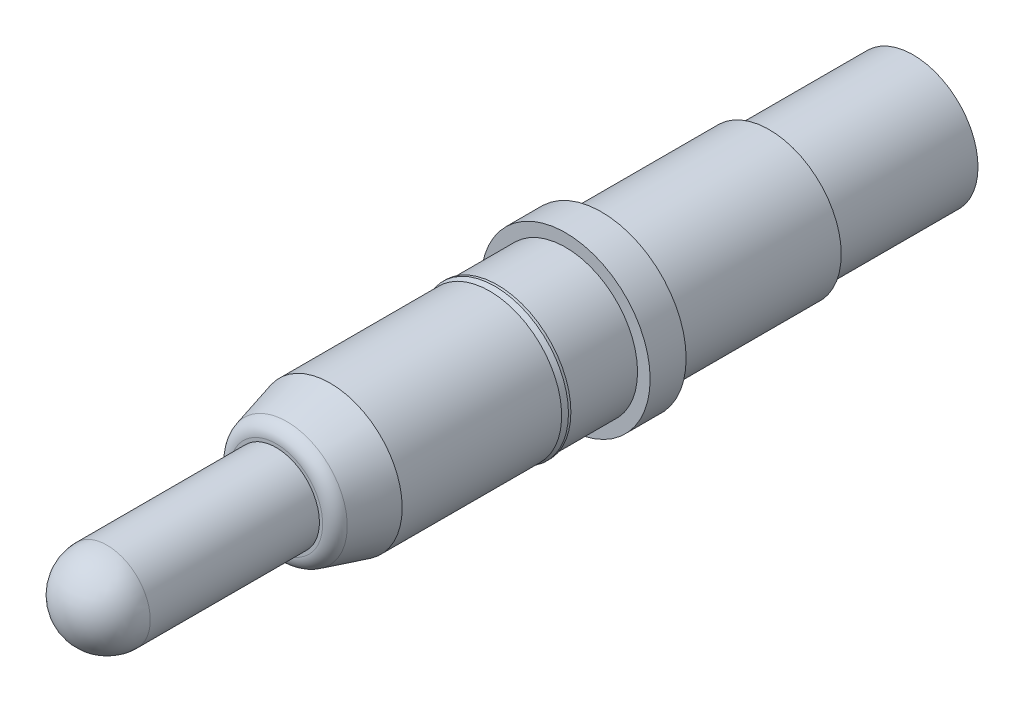
ISO-10303-21;
HEADER;
FILE_DESCRIPTION(('STEP AP214'),'2;1');
FILE_NAME('part.step','',(''),(''),'','','');
FILE_SCHEMA(('AUTOMOTIVE_DESIGN { 1 0 10303 214 1 1 1 1 }'));
ENDSEC;
DATA;
#1=APPLICATION_CONTEXT('core data for automotive mechanical design processes');
#2=APPLICATION_PROTOCOL_DEFINITION('international standard','automotive_design',2000,#1);
#3=PRODUCT_CONTEXT('',#1,'mechanical');
#4=PRODUCT('Part','Part','',(#3));
#5=PRODUCT_RELATED_PRODUCT_CATEGORY('part','',(#4));
#6=PRODUCT_DEFINITION_FORMATION('','',#4);
#7=PRODUCT_DEFINITION_CONTEXT('part definition',#1,'design');
#8=PRODUCT_DEFINITION('design','',#6,#7);
#9=PRODUCT_DEFINITION_SHAPE('','',#8);
#10=(LENGTH_UNIT() NAMED_UNIT(*) SI_UNIT(.MILLI.,.METRE.));
#11=(NAMED_UNIT(*) PLANE_ANGLE_UNIT() SI_UNIT($,.RADIAN.));
#12=(NAMED_UNIT(*) SI_UNIT($,.STERADIAN.) SOLID_ANGLE_UNIT());
#13=UNCERTAINTY_MEASURE_WITH_UNIT(LENGTH_MEASURE(1.E-05),#10,'distance_accuracy_value','');
#14=(GEOMETRIC_REPRESENTATION_CONTEXT(3) GLOBAL_UNCERTAINTY_ASSIGNED_CONTEXT((#13)) GLOBAL_UNIT_ASSIGNED_CONTEXT((#10,
#11,#12)) REPRESENTATION_CONTEXT('',''));
#15=CARTESIAN_POINT('',(0.,0.,0.));
#16=DIRECTION('',(0.,0.,1.));
#17=DIRECTION('',(1.,0.,0.));
#18=AXIS2_PLACEMENT_3D('',#15,#16,#17);
#19=CARTESIAN_POINT('',(0.,0.,6.37));
#20=DIRECTION('',(0.,-1.,0.));
#21=DIRECTION('',(0.,0.,-1.));
#22=AXIS2_PLACEMENT_3D('',#19,#20,#21);
#23=SPHERICAL_SURFACE('',#22,0.6);
#24=CARTESIAN_POINT('',(0.,0.,6.37));
#25=DIRECTION('',(0.,0.,1.));
#26=DIRECTION('',(0.,-1.,0.));
#27=AXIS2_PLACEMENT_3D('',#24,#25,#26);
#28=CIRCLE('',#27,0.6);
#29=CARTESIAN_POINT('',(0.,0.6,6.37));
#30=VERTEX_POINT('',#29);
#31=CARTESIAN_POINT('',(0.,-0.6,6.37));
#32=VERTEX_POINT('',#31);
#33=EDGE_CURVE('E35',#30,#32,#28,.F.);
#34=ORIENTED_EDGE('',*,*,#33,.F.);
#35=CARTESIAN_POINT('',(0.,0.,6.37));
#36=DIRECTION('',(0.,0.,1.));
#37=DIRECTION('',(0.,-1.,0.));
#38=AXIS2_PLACEMENT_3D('',#35,#36,#37);
#39=CIRCLE('',#38,0.6);
#40=EDGE_CURVE('E37',#32,#30,#39,.F.);
#41=ORIENTED_EDGE('',*,*,#40,.F.);
#42=EDGE_LOOP('',(#34,#41));
#43=FACE_BOUND('',#42,.T.);
#44=ADVANCED_FACE('F18',(#43),#23,.T.);
#45=CARTESIAN_POINT('',(0.,0.,6.97));
#46=DIRECTION('',(0.,0.,1.));
#47=DIRECTION('',(0.,-1.,0.));
#48=AXIS2_PLACEMENT_3D('',#45,#46,#47);
#49=CYLINDRICAL_SURFACE('',#48,0.6);
#50=CARTESIAN_POINT('',(0.,0.,4.02));
#51=DIRECTION('',(0.,0.,1.));
#52=DIRECTION('',(0.,-1.,0.));
#53=AXIS2_PLACEMENT_3D('',#50,#51,#52);
#54=CIRCLE('',#53,0.6);
#55=CARTESIAN_POINT('',(0.,-0.6,4.02));
#56=VERTEX_POINT('',#55);
#57=EDGE_CURVE('E44',#56,#56,#54,.T.);
#58=ORIENTED_EDGE('',*,*,#57,.T.);
#59=EDGE_LOOP('',(#58));
#60=FACE_BOUND('',#59,.T.);
#61=ORIENTED_EDGE('',*,*,#33,.T.);
#62=ORIENTED_EDGE('',*,*,#40,.T.);
#63=EDGE_LOOP('',(#61,#62));
#64=FACE_BOUND('',#63,.T.);
#65=ADVANCED_FACE('F42',(#60,#64),#49,.T.);
#66=CARTESIAN_POINT('',(0.,0.,4.02));
#67=DIRECTION('',(0.,0.,-1.));
#68=DIRECTION('',(-1.,0.,0.));
#69=AXIS2_PLACEMENT_3D('',#66,#67,#68);
#70=PLANE('',#69);
#71=CARTESIAN_POINT('',(0.,0.,4.02));
#72=DIRECTION('',(0.,0.,-1.));
#73=DIRECTION('',(-1.,0.,0.));
#74=AXIS2_PLACEMENT_3D('',#71,#72,#73);
#75=CIRCLE('',#74,0.645572708080866);
#76=CARTESIAN_POINT('',(-0.645572708080866,0.,4.02));
#77=VERTEX_POINT('',#76);
#78=EDGE_CURVE('E49',#77,#77,#75,.T.);
#79=ORIENTED_EDGE('',*,*,#78,.F.);
#80=EDGE_LOOP('',(#79));
#81=FACE_BOUND('',#80,.T.);
#82=ORIENTED_EDGE('',*,*,#57,.F.);
#83=EDGE_LOOP('',(#82));
#84=FACE_BOUND('',#83,.T.);
#85=ADVANCED_FACE('F146',(#81,#84),#70,.F.);
#86=CARTESIAN_POINT('',(0.,0.,3.82));
#87=DIRECTION('',(0.,0.,-1.));
#88=DIRECTION('',(-1.,0.,0.));
#89=AXIS2_PLACEMENT_3D('',#86,#87,#88);
#90=TOROIDAL_SURFACE('',#89,0.645572708080866,0.2);
#91=ORIENTED_EDGE('',*,*,#78,.T.);
#92=EDGE_LOOP('',(#91));
#93=FACE_BOUND('',#92,.T.);
#94=CARTESIAN_POINT('',(0.,0.,3.87176380905885));
#95=DIRECTION('',(0.,0.,-1.));
#96=DIRECTION('',(-1.,0.,0.));
#97=AXIS2_PLACEMENT_3D('',#94,#95,#96);
#98=CIRCLE('',#97,0.838757873339091);
#99=CARTESIAN_POINT('',(-0.838757873339091,0.,3.87176380905885));
#100=VERTEX_POINT('',#99);
#101=EDGE_CURVE('E237',#100,#100,#98,.T.);
#102=ORIENTED_EDGE('',*,*,#101,.F.);
#103=EDGE_LOOP('',(#102));
#104=FACE_BOUND('',#103,.T.);
#105=ADVANCED_FACE('F140',(#93,#104),#90,.T.);
#106=CARTESIAN_POINT('',(0.,0.,3.27000000027056));
#107=DIRECTION('',(0.,0.,-1.));
#108=DIRECTION('',(-1.,0.,0.));
#109=AXIS2_PLACEMENT_3D('',#106,#107,#108);
#110=CONICAL_SURFACE('',#109,0.999999999947931,0.261799387807925);
#111=CARTESIAN_POINT('',(0.,0.,3.27));
#112=DIRECTION('',(0.,0.,1.));
#113=DIRECTION('',(1.,0.,0.));
#114=AXIS2_PLACEMENT_3D('',#111,#112,#113);
#115=CIRCLE('',#114,1.);
#116=CARTESIAN_POINT('',(1.,0.,3.27));
#117=VERTEX_POINT('',#116);
#118=EDGE_CURVE('E224',#117,#117,#115,.F.);
#119=ORIENTED_EDGE('',*,*,#118,.F.);
#120=EDGE_LOOP('',(#119));
#121=FACE_BOUND('',#120,.T.);
#122=ORIENTED_EDGE('',*,*,#101,.T.);
#123=EDGE_LOOP('',(#122));
#124=FACE_BOUND('',#123,.T.);
#125=ADVANCED_FACE('F136',(#121,#124),#110,.T.);
#126=CARTESIAN_POINT('',(0.,0.,4.02));
#127=DIRECTION('',(0.,0.,1.));
#128=DIRECTION('',(1.,0.,0.));
#129=AXIS2_PLACEMENT_3D('',#126,#127,#128);
#130=CYLINDRICAL_SURFACE('',#129,1.);
#131=CARTESIAN_POINT('',(0.,0.,1.05442139880552));
#132=DIRECTION('',(0.,0.,-1.));
#133=DIRECTION('',(-1.,0.,0.));
#134=AXIS2_PLACEMENT_3D('',#131,#132,#133);
#135=CIRCLE('',#134,1.00000000000477);
#136=CARTESIAN_POINT('',(-1.00000000000477,0.,1.05442139880552));
#137=VERTEX_POINT('',#136);
#138=EDGE_CURVE('E218',#137,#137,#135,.T.);
#139=ORIENTED_EDGE('',*,*,#138,.F.);
#140=EDGE_LOOP('',(#139));
#141=FACE_BOUND('',#140,.T.);
#142=ORIENTED_EDGE('',*,*,#118,.T.);
#143=EDGE_LOOP('',(#142));
#144=FACE_BOUND('',#143,.T.);
#145=ADVANCED_FACE('F132',(#141,#144),#130,.T.);
#146=CARTESIAN_POINT('',(0.,0.,0.979780382863282));
#147=DIRECTION('',(0.,0.,-1.));
#148=DIRECTION('',(-1.,0.,0.));
#149=AXIS2_PLACEMENT_3D('',#146,#147,#148);
#150=CONICAL_SURFACE('',#149,1.01999999995428,0.261799387842951);
#151=CARTESIAN_POINT('',(0.,0.,0.979780382717352));
#152=DIRECTION('',(0.,0.,1.));
#153=DIRECTION('',(1.,0.,0.));
#154=AXIS2_PLACEMENT_3D('',#151,#152,#153);
#155=CIRCLE('',#154,1.02);
#156=CARTESIAN_POINT('',(1.02,0.,0.979780382717352));
#157=VERTEX_POINT('',#156);
#158=EDGE_CURVE('E214',#157,#157,#155,.F.);
#159=ORIENTED_EDGE('',*,*,#158,.F.);
#160=EDGE_LOOP('',(#159));
#161=FACE_BOUND('',#160,.T.);
#162=ORIENTED_EDGE('',*,*,#138,.T.);
#163=EDGE_LOOP('',(#162));
#164=FACE_BOUND('',#163,.T.);
#165=ADVANCED_FACE('F128',(#161,#164),#150,.T.);
#166=CARTESIAN_POINT('',(0.,0.,4.02));
#167=DIRECTION('',(0.,0.,1.));
#168=DIRECTION('',(1.,0.,0.));
#169=AXIS2_PLACEMENT_3D('',#166,#167,#168);
#170=CYLINDRICAL_SURFACE('',#169,1.02);
#171=CARTESIAN_POINT('',(0.,0.,0.946167322600402));
#172=DIRECTION('',(0.,0.,1.));
#173=DIRECTION('',(1.,0.,0.));
#174=AXIS2_PLACEMENT_3D('',#171,#172,#173);
#175=CIRCLE('',#174,1.02);
#176=CARTESIAN_POINT('',(1.02,0.,0.946167322600402));
#177=VERTEX_POINT('',#176);
#178=EDGE_CURVE('E211',#177,#177,#175,.T.);
#179=ORIENTED_EDGE('',*,*,#178,.T.);
#180=EDGE_LOOP('',(#179));
#181=FACE_BOUND('',#180,.T.);
#182=ORIENTED_EDGE('',*,*,#158,.T.);
#183=EDGE_LOOP('',(#182));
#184=FACE_BOUND('',#183,.T.);
#185=ADVANCED_FACE('F124',(#181,#184),#170,.T.);
#186=CARTESIAN_POINT('',(0.,0.,-3.23));
#187=DIRECTION('',(0.,0.,-1.));
#188=DIRECTION('',(-1.,0.,0.));
#189=AXIS2_PLACEMENT_3D('',#186,#187,#188);
#190=PLANE('',#189);
#191=CARTESIAN_POINT('',(0.,0.,-3.23));
#192=DIRECTION('',(0.,0.,-1.));
#193=DIRECTION('',(-1.,0.,0.));
#194=AXIS2_PLACEMENT_3D('',#191,#192,#193);
#195=CIRCLE('',#194,0.735);
#196=CARTESIAN_POINT('',(-0.735,0.,-3.23));
#197=VERTEX_POINT('',#196);
#198=EDGE_CURVE('E208',#197,#197,#195,.T.);
#199=ORIENTED_EDGE('',*,*,#198,.T.);
#200=EDGE_LOOP('',(#199));
#201=FACE_BOUND('',#200,.T.);
#202=ADVANCED_FACE('F120',(#201),#190,.T.);
#203=CARTESIAN_POINT('',(0.,1.02,0.946167322600402));
#204=DIRECTION('',(0.,0.,1.));
#205=DIRECTION('',(1.,0.,0.));
#206=AXIS2_PLACEMENT_3D('',#203,#204,#205);
#207=PLANE('',#206);
#208=CARTESIAN_POINT('',(0.,0.,0.946167322600402));
#209=DIRECTION('',(0.,0.,1.));
#210=DIRECTION('',(1.,0.,0.));
#211=AXIS2_PLACEMENT_3D('',#208,#209,#210);
#212=CIRCLE('',#211,1.);
#213=CARTESIAN_POINT('',(1.,0.,0.946167322600402));
#214=VERTEX_POINT('',#213);
#215=EDGE_CURVE('E204',#214,#214,#212,.F.);
#216=ORIENTED_EDGE('',*,*,#215,.F.);
#217=EDGE_LOOP('',(#216));
#218=FACE_BOUND('',#217,.T.);
#219=ORIENTED_EDGE('',*,*,#178,.F.);
#220=EDGE_LOOP('',(#219));
#221=FACE_BOUND('',#220,.T.);
#222=ADVANCED_FACE('F116',(#218,#221),#207,.F.);
#223=CARTESIAN_POINT('',(0.,0.,-3.23));
#224=DIRECTION('',(0.,0.,-1.));
#225=DIRECTION('',(-1.,0.,0.));
#226=AXIS2_PLACEMENT_3D('',#223,#224,#225);
#227=CYLINDRICAL_SURFACE('',#226,0.735);
#228=ORIENTED_EDGE('',*,*,#198,.F.);
#229=EDGE_LOOP('',(#228));
#230=FACE_BOUND('',#229,.T.);
#231=CARTESIAN_POINT('',(0.,0.,-4.72999999999502));
#232=DIRECTION('',(0.,0.,-1.));
#233=DIRECTION('',(-1.,0.,0.));
#234=AXIS2_PLACEMENT_3D('',#231,#232,#233);
#235=CIRCLE('',#234,0.73500000007698);
#236=CARTESIAN_POINT('',(-0.73500000007698,0.,-4.72999999999502));
#237=VERTEX_POINT('',#236);
#238=EDGE_CURVE('E203',#237,#237,#235,.T.);
#239=ORIENTED_EDGE('',*,*,#238,.T.);
#240=EDGE_LOOP('',(#239));
#241=FACE_BOUND('',#240,.T.);
#242=ADVANCED_FACE('F112',(#230,#241),#227,.F.);
#243=CARTESIAN_POINT('',(0.,0.,4.02));
#244=DIRECTION('',(0.,0.,1.));
#245=DIRECTION('',(1.,0.,0.));
#246=AXIS2_PLACEMENT_3D('',#243,#244,#245);
#247=CYLINDRICAL_SURFACE('',#246,1.);
#248=CARTESIAN_POINT('',(0.,0.,0.));
#249=DIRECTION('',(0.,0.,1.));
#250=DIRECTION('',(1.,0.,0.));
#251=AXIS2_PLACEMENT_3D('',#248,#249,#250);
#252=CIRCLE('',#251,1.);
#253=CARTESIAN_POINT('',(1.,0.,0.));
#254=VERTEX_POINT('',#253);
#255=EDGE_CURVE('E199',#254,#254,#252,.T.);
#256=ORIENTED_EDGE('',*,*,#255,.T.);
#257=EDGE_LOOP('',(#256));
#258=FACE_BOUND('',#257,.T.);
#259=ORIENTED_EDGE('',*,*,#215,.T.);
#260=EDGE_LOOP('',(#259));
#261=FACE_BOUND('',#260,.T.);
#262=ADVANCED_FACE('F108',(#258,#261),#247,.T.);
#263=CARTESIAN_POINT('',(0.,0.,-4.83000000002676));
#264=DIRECTION('',(0.,0.,-1.));
#265=DIRECTION('',(-1.,0.,0.));
#266=AXIS2_PLACEMENT_3D('',#263,#264,#265);
#267=CONICAL_SURFACE('',#266,0.835000000051878,0.785398163113231);
#268=ORIENTED_EDGE('',*,*,#238,.F.);
#269=EDGE_LOOP('',(#268));
#270=FACE_BOUND('',#269,.T.);
#271=CARTESIAN_POINT('',(0.,0.,-4.83000000002676));
#272=DIRECTION('',(0.,0.,-1.));
#273=DIRECTION('',(-1.,0.,0.));
#274=AXIS2_PLACEMENT_3D('',#271,#272,#273);
#275=CIRCLE('',#274,0.835000000051878);
#276=CARTESIAN_POINT('',(-0.835000000051878,0.,-4.83000000002676));
#277=VERTEX_POINT('',#276);
#278=EDGE_CURVE('E195',#277,#277,#275,.T.);
#279=ORIENTED_EDGE('',*,*,#278,.T.);
#280=EDGE_LOOP('',(#279));
#281=FACE_BOUND('',#280,.T.);
#282=ADVANCED_FACE('F104',(#270,#281),#267,.F.);
#283=CARTESIAN_POINT('',(0.,1.,0.));
#284=DIRECTION('',(0.,0.,-1.));
#285=DIRECTION('',(-1.,0.,0.));
#286=AXIS2_PLACEMENT_3D('',#283,#284,#285);
#287=PLANE('',#286);
#288=CARTESIAN_POINT('',(0.,0.,0.));
#289=DIRECTION('',(0.,0.,1.));
#290=DIRECTION('',(1.,0.,0.));
#291=AXIS2_PLACEMENT_3D('',#288,#289,#290);
#292=CIRCLE('',#291,1.175);
#293=CARTESIAN_POINT('',(1.175,0.,0.));
#294=VERTEX_POINT('',#293);
#295=EDGE_CURVE('E191',#294,#294,#292,.F.);
#296=ORIENTED_EDGE('',*,*,#295,.F.);
#297=EDGE_LOOP('',(#296));
#298=FACE_BOUND('',#297,.T.);
#299=ORIENTED_EDGE('',*,*,#255,.F.);
#300=EDGE_LOOP('',(#299));
#301=FACE_BOUND('',#300,.T.);
#302=ADVANCED_FACE('F100',(#298,#301),#287,.F.);
#303=CARTESIAN_POINT('',(0.,0.9,-4.83));
#304=DIRECTION('',(0.,0.,1.));
#305=DIRECTION('',(1.,0.,0.));
#306=AXIS2_PLACEMENT_3D('',#303,#304,#305);
#307=PLANE('',#306);
#308=CARTESIAN_POINT('',(0.,0.,-4.83));
#309=DIRECTION('',(0.,0.,1.));
#310=DIRECTION('',(1.,0.,0.));
#311=AXIS2_PLACEMENT_3D('',#308,#309,#310);
#312=CIRCLE('',#311,0.9);
#313=CARTESIAN_POINT('',(0.9,0.,-4.83));
#314=VERTEX_POINT('',#313);
#315=EDGE_CURVE('E187',#314,#314,#312,.T.);
#316=ORIENTED_EDGE('',*,*,#315,.F.);
#317=EDGE_LOOP('',(#316));
#318=FACE_BOUND('',#317,.T.);
#319=ORIENTED_EDGE('',*,*,#278,.F.);
#320=EDGE_LOOP('',(#319));
#321=FACE_BOUND('',#320,.T.);
#322=ADVANCED_FACE('F96',(#318,#321),#307,.F.);
#323=CARTESIAN_POINT('',(0.,0.,4.02));
#324=DIRECTION('',(0.,0.,1.));
#325=DIRECTION('',(1.,0.,0.));
#326=AXIS2_PLACEMENT_3D('',#323,#324,#325);
#327=CYLINDRICAL_SURFACE('',#326,1.175);
#328=CARTESIAN_POINT('',(0.,0.,-0.5));
#329=DIRECTION('',(0.,0.,1.));
#330=DIRECTION('',(1.,0.,0.));
#331=AXIS2_PLACEMENT_3D('',#328,#329,#330);
#332=CIRCLE('',#331,1.175);
#333=CARTESIAN_POINT('',(1.175,0.,-0.5));
#334=VERTEX_POINT('',#333);
#335=EDGE_CURVE('E183',#334,#334,#332,.T.);
#336=ORIENTED_EDGE('',*,*,#335,.T.);
#337=EDGE_LOOP('',(#336));
#338=FACE_BOUND('',#337,.T.);
#339=ORIENTED_EDGE('',*,*,#295,.T.);
#340=EDGE_LOOP('',(#339));
#341=FACE_BOUND('',#340,.T.);
#342=ADVANCED_FACE('F92',(#338,#341),#327,.T.);
#343=CARTESIAN_POINT('',(0.,0.,4.02));
#344=DIRECTION('',(0.,0.,1.));
#345=DIRECTION('',(1.,0.,0.));
#346=AXIS2_PLACEMENT_3D('',#343,#344,#345);
#347=CYLINDRICAL_SURFACE('',#346,0.9);
#348=ORIENTED_EDGE('',*,*,#315,.T.);
#349=EDGE_LOOP('',(#348));
#350=FACE_BOUND('',#349,.T.);
#351=CARTESIAN_POINT('',(0.,0.,-2.83));
#352=DIRECTION('',(0.,0.,1.));
#353=DIRECTION('',(1.,0.,0.));
#354=AXIS2_PLACEMENT_3D('',#351,#352,#353);
#355=CIRCLE('',#354,0.9);
#356=CARTESIAN_POINT('',(0.9,0.,-2.83));
#357=VERTEX_POINT('',#356);
#358=EDGE_CURVE('E179',#357,#357,#355,.F.);
#359=ORIENTED_EDGE('',*,*,#358,.T.);
#360=EDGE_LOOP('',(#359));
#361=FACE_BOUND('',#360,.T.);
#362=ADVANCED_FACE('F88',(#350,#361),#347,.T.);
#363=CARTESIAN_POINT('',(0.,1.175,-0.5));
#364=DIRECTION('',(0.,0.,1.));
#365=DIRECTION('',(1.,0.,0.));
#366=AXIS2_PLACEMENT_3D('',#363,#364,#365);
#367=PLANE('',#366);
#368=CARTESIAN_POINT('',(0.,0.,-0.5));
#369=DIRECTION('',(0.,0.,1.));
#370=DIRECTION('',(1.,0.,0.));
#371=AXIS2_PLACEMENT_3D('',#368,#369,#370);
#372=CIRCLE('',#371,1.);
#373=CARTESIAN_POINT('',(1.,0.,-0.5));
#374=VERTEX_POINT('',#373);
#375=EDGE_CURVE('E29',#374,#374,#372,.F.);
#376=ORIENTED_EDGE('',*,*,#375,.F.);
#377=EDGE_LOOP('',(#376));
#378=FACE_BOUND('',#377,.T.);
#379=ORIENTED_EDGE('',*,*,#335,.F.);
#380=EDGE_LOOP('',(#379));
#381=FACE_BOUND('',#380,.T.);
#382=ADVANCED_FACE('F84',(#378,#381),#367,.F.);
#383=CARTESIAN_POINT('',(0.,1.,-2.83));
#384=DIRECTION('',(0.,0.,1.));
#385=DIRECTION('',(1.,0.,0.));
#386=AXIS2_PLACEMENT_3D('',#383,#384,#385);
#387=PLANE('',#386);
#388=ORIENTED_EDGE('',*,*,#358,.F.);
#389=EDGE_LOOP('',(#388));
#390=FACE_BOUND('',#389,.T.);
#391=CARTESIAN_POINT('',(0.,0.,-2.83));
#392=DIRECTION('',(0.,0.,1.));
#393=DIRECTION('',(1.,0.,0.));
#394=AXIS2_PLACEMENT_3D('',#391,#392,#393);
#395=CIRCLE('',#394,1.);
#396=CARTESIAN_POINT('',(1.,0.,-2.83));
#397=VERTEX_POINT('',#396);
#398=EDGE_CURVE('E11',#397,#397,#395,.T.);
#399=ORIENTED_EDGE('',*,*,#398,.F.);
#400=EDGE_LOOP('',(#399));
#401=FACE_BOUND('',#400,.T.);
#402=ADVANCED_FACE('F80',(#390,#401),#387,.F.);
#403=CARTESIAN_POINT('',(0.,0.,4.02));
#404=DIRECTION('',(0.,0.,1.));
#405=DIRECTION('',(1.,0.,0.));
#406=AXIS2_PLACEMENT_3D('',#403,#404,#405);
#407=CYLINDRICAL_SURFACE('',#406,1.);
#408=ORIENTED_EDGE('',*,*,#398,.T.);
#409=EDGE_LOOP('',(#408));
#410=FACE_BOUND('',#409,.T.);
#411=ORIENTED_EDGE('',*,*,#375,.T.);
#412=EDGE_LOOP('',(#411));
#413=FACE_BOUND('',#412,.T.);
#414=ADVANCED_FACE('F77',(#410,#413),#407,.T.);
#415=CLOSED_SHELL('',(#44,#65,#85,#105,#125,#145,#165,#185,#202,#222,#242,#262,#282,#302,#322,
#342,#362,#382,#402,#414));
#416=CARTESIAN_POINT('',(0.,0.,3.02));
#417=DIRECTION('',(0.,0.,-1.));
#418=DIRECTION('',(0.,1.,0.));
#419=AXIS2_PLACEMENT_3D('',#416,#417,#418);
#420=PLANE('',#419);
#421=CARTESIAN_POINT('',(0.,0.,3.02));
#422=DIRECTION('',(0.,0.,1.));
#423=DIRECTION('',(1.,0.,0.));
#424=AXIS2_PLACEMENT_3D('',#421,#422,#423);
#425=CIRCLE('',#424,0.6);
#426=CARTESIAN_POINT('',(0.6,0.,3.02));
#427=VERTEX_POINT('',#426);
#428=EDGE_CURVE('E22',#427,#427,#425,.F.);
#429=ORIENTED_EDGE('',*,*,#428,.T.);
#430=EDGE_LOOP('',(#429));
#431=FACE_BOUND('',#430,.T.);
#432=ADVANCED_FACE('F60',(#431),#420,.T.);
#433=CARTESIAN_POINT('',(0.,0.,-0.980000000000003));
#434=DIRECTION('',(0.,0.,1.));
#435=DIRECTION('',(1.,0.,0.));
#436=AXIS2_PLACEMENT_3D('',#433,#434,#435);
#437=PLANE('',#436);
#438=CARTESIAN_POINT('',(0.,0.,-0.980000000000003));
#439=DIRECTION('',(0.,0.,1.));
#440=DIRECTION('',(1.,0.,0.));
#441=AXIS2_PLACEMENT_3D('',#438,#439,#440);
#442=CIRCLE('',#441,0.6);
#443=CARTESIAN_POINT('',(0.6,0.,-0.980000000000003));
#444=VERTEX_POINT('',#443);
#445=EDGE_CURVE('E40',#444,#444,#442,.T.);
#446=ORIENTED_EDGE('',*,*,#445,.T.);
#447=EDGE_LOOP('',(#446));
#448=FACE_BOUND('',#447,.T.);
#449=ADVANCED_FACE('F64',(#448),#437,.T.);
#450=CARTESIAN_POINT('',(0.,0.,-0.980000000000003));
#451=DIRECTION('',(0.,0.,1.));
#452=DIRECTION('',(1.,0.,0.));
#453=AXIS2_PLACEMENT_3D('',#450,#451,#452);
#454=CYLINDRICAL_SURFACE('',#453,0.6);
#455=ORIENTED_EDGE('',*,*,#445,.F.);
#456=EDGE_LOOP('',(#455));
#457=FACE_BOUND('',#456,.T.);
#458=ORIENTED_EDGE('',*,*,#428,.F.);
#459=EDGE_LOOP('',(#458));
#460=FACE_BOUND('',#459,.T.);
#461=ADVANCED_FACE('F62',(#457,#460),#454,.F.);
#462=CLOSED_SHELL('',(#432,#449,#461));
#463=ORIENTED_CLOSED_SHELL('',*,#462,.T.);
#464=BREP_WITH_VOIDS('B1',#415,(#463));
#465=ADVANCED_BREP_SHAPE_REPRESENTATION('',(#18,#464),#14);
#466=SHAPE_DEFINITION_REPRESENTATION(#9,#465);
ENDSEC;
END-ISO-10303-21;
